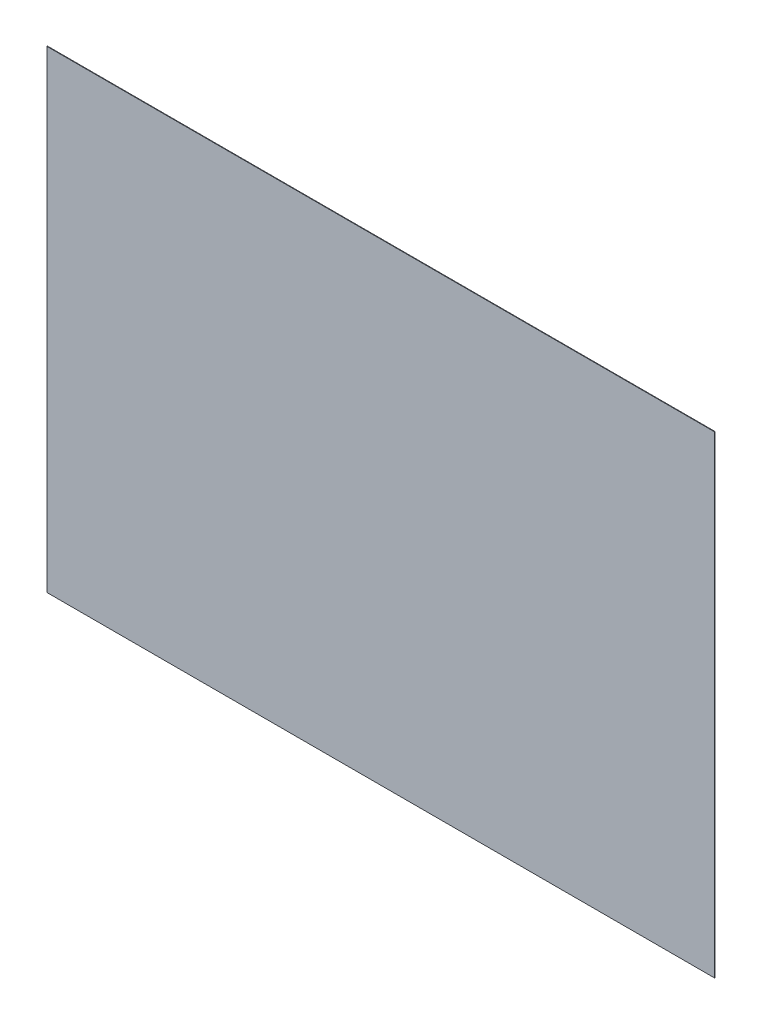
ISO-10303-21;
HEADER;
FILE_DESCRIPTION(('STEP AP214'),'2;1');
FILE_NAME('part.step','',(''),(''),'','','');
FILE_SCHEMA(('AUTOMOTIVE_DESIGN { 1 0 10303 214 1 1 1 1 }'));
ENDSEC;
DATA;
#1=APPLICATION_CONTEXT('core data for automotive mechanical design processes');
#2=APPLICATION_PROTOCOL_DEFINITION('international standard','automotive_design',2000,#1);
#3=PRODUCT_CONTEXT('',#1,'mechanical');
#4=PRODUCT('Part','Part','',(#3));
#5=PRODUCT_RELATED_PRODUCT_CATEGORY('part','',(#4));
#6=PRODUCT_DEFINITION_FORMATION('','',#4);
#7=PRODUCT_DEFINITION_CONTEXT('part definition',#1,'design');
#8=PRODUCT_DEFINITION('design','',#6,#7);
#9=PRODUCT_DEFINITION_SHAPE('','',#8);
#10=(LENGTH_UNIT() NAMED_UNIT(*) SI_UNIT(.MILLI.,.METRE.));
#11=(NAMED_UNIT(*) PLANE_ANGLE_UNIT() SI_UNIT($,.RADIAN.));
#12=(NAMED_UNIT(*) SI_UNIT($,.STERADIAN.) SOLID_ANGLE_UNIT());
#13=UNCERTAINTY_MEASURE_WITH_UNIT(LENGTH_MEASURE(1.E-05),#10,'distance_accuracy_value','');
#14=(GEOMETRIC_REPRESENTATION_CONTEXT(3) GLOBAL_UNCERTAINTY_ASSIGNED_CONTEXT((#13)) GLOBAL_UNIT_ASSIGNED_CONTEXT((#10,
#11,#12)) REPRESENTATION_CONTEXT('',''));
#15=CARTESIAN_POINT('',(0.,0.,0.));
#16=DIRECTION('',(0.,0.,1.));
#17=DIRECTION('',(1.,0.,0.));
#18=AXIS2_PLACEMENT_3D('',#15,#16,#17);
#19=CARTESIAN_POINT('',(-304.8,-215.9,0.5));
#20=DIRECTION('',(1.,0.,0.));
#21=DIRECTION('',(0.,0.,-1.));
#22=AXIS2_PLACEMENT_3D('',#19,#20,#21);
#23=PLANE('',#22);
#24=DIRECTION('',(0.,-1.,0.));
#25=VECTOR('',#24,1.);
#26=CARTESIAN_POINT('',(-304.8,-215.9,0.));
#27=LINE('',#26,#25);
#28=CARTESIAN_POINT('',(-304.8,215.9,0.));
#29=VERTEX_POINT('',#28);
#30=CARTESIAN_POINT('',(-304.8,-215.9,0.));
#31=VERTEX_POINT('',#30);
#32=EDGE_CURVE('E99',#29,#31,#27,.T.);
#33=ORIENTED_EDGE('',*,*,#32,.T.);
#34=DIRECTION('',(0.,0.,-1.));
#35=VECTOR('',#34,1.);
#36=CARTESIAN_POINT('',(-304.8,-215.9,0.5));
#37=LINE('',#36,#35);
#38=CARTESIAN_POINT('',(-304.8,-215.9,0.5));
#39=VERTEX_POINT('',#38);
#40=EDGE_CURVE('E11',#39,#31,#37,.T.);
#41=ORIENTED_EDGE('',*,*,#40,.F.);
#42=DIRECTION('',(0.,-1.,0.));
#43=VECTOR('',#42,1.);
#44=CARTESIAN_POINT('',(-304.8,-215.9,0.5));
#45=LINE('',#44,#43);
#46=CARTESIAN_POINT('',(-304.8,215.9,0.5));
#47=VERTEX_POINT('',#46);
#48=EDGE_CURVE('E87',#47,#39,#45,.T.);
#49=ORIENTED_EDGE('',*,*,#48,.F.);
#50=DIRECTION('',(0.,0.,-1.));
#51=VECTOR('',#50,1.);
#52=CARTESIAN_POINT('',(-304.8,215.9,0.5));
#53=LINE('',#52,#51);
#54=EDGE_CURVE('E95',#47,#29,#53,.T.);
#55=ORIENTED_EDGE('',*,*,#54,.T.);
#56=EDGE_LOOP('',(#33,#41,#49,#55));
#57=FACE_BOUND('',#56,.T.);
#58=ADVANCED_FACE('F36',(#57),#23,.F.);
#59=CARTESIAN_POINT('',(304.8,-215.9,0.5));
#60=DIRECTION('',(0.,1.,0.));
#61=DIRECTION('',(-1.,0.,0.));
#62=AXIS2_PLACEMENT_3D('',#59,#60,#61);
#63=PLANE('',#62);
#64=DIRECTION('',(1.,0.,0.));
#65=VECTOR('',#64,1.);
#66=CARTESIAN_POINT('',(304.8,-215.9,0.));
#67=LINE('',#66,#65);
#68=CARTESIAN_POINT('',(304.8,-215.9,0.));
#69=VERTEX_POINT('',#68);
#70=EDGE_CURVE('E91',#31,#69,#67,.T.);
#71=ORIENTED_EDGE('',*,*,#70,.T.);
#72=DIRECTION('',(0.,0.,-1.));
#73=VECTOR('',#72,1.);
#74=CARTESIAN_POINT('',(304.8,-215.9,0.5));
#75=LINE('',#74,#73);
#76=CARTESIAN_POINT('',(304.8,-215.9,0.5));
#77=VERTEX_POINT('',#76);
#78=EDGE_CURVE('E44',#77,#69,#75,.T.);
#79=ORIENTED_EDGE('',*,*,#78,.F.);
#80=DIRECTION('',(1.,0.,0.));
#81=VECTOR('',#80,1.);
#82=CARTESIAN_POINT('',(304.8,-215.9,0.5));
#83=LINE('',#82,#81);
#84=EDGE_CURVE('E82',#39,#77,#83,.T.);
#85=ORIENTED_EDGE('',*,*,#84,.F.);
#86=ORIENTED_EDGE('',*,*,#40,.T.);
#87=EDGE_LOOP('',(#71,#79,#85,#86));
#88=FACE_BOUND('',#87,.T.);
#89=ADVANCED_FACE('F90',(#88),#63,.F.);
#90=CARTESIAN_POINT('',(304.8,-215.9,0.5));
#91=DIRECTION('',(-1.,0.,0.));
#92=DIRECTION('',(0.,0.,1.));
#93=AXIS2_PLACEMENT_3D('',#90,#91,#92);
#94=PLANE('',#93);
#95=DIRECTION('',(0.,1.,0.));
#96=VECTOR('',#95,1.);
#97=CARTESIAN_POINT('',(304.8,-215.9,0.));
#98=LINE('',#97,#96);
#99=CARTESIAN_POINT('',(304.8,215.9,0.));
#100=VERTEX_POINT('',#99);
#101=EDGE_CURVE('E69',#69,#100,#98,.T.);
#102=ORIENTED_EDGE('',*,*,#101,.T.);
#103=DIRECTION('',(0.,0.,-1.));
#104=VECTOR('',#103,1.);
#105=CARTESIAN_POINT('',(304.8,215.9,0.5));
#106=LINE('',#105,#104);
#107=CARTESIAN_POINT('',(304.8,215.9,0.5));
#108=VERTEX_POINT('',#107);
#109=EDGE_CURVE('E92',#108,#100,#106,.T.);
#110=ORIENTED_EDGE('',*,*,#109,.F.);
#111=DIRECTION('',(0.,1.,0.));
#112=VECTOR('',#111,1.);
#113=CARTESIAN_POINT('',(304.8,-215.9,0.5));
#114=LINE('',#113,#112);
#115=EDGE_CURVE('E85',#77,#108,#114,.T.);
#116=ORIENTED_EDGE('',*,*,#115,.F.);
#117=ORIENTED_EDGE('',*,*,#78,.T.);
#118=EDGE_LOOP('',(#102,#110,#116,#117));
#119=FACE_BOUND('',#118,.T.);
#120=ADVANCED_FACE('F93',(#119),#94,.F.);
#121=CARTESIAN_POINT('',(304.8,215.9,0.5));
#122=DIRECTION('',(0.,-1.,0.));
#123=DIRECTION('',(1.,0.,0.));
#124=AXIS2_PLACEMENT_3D('',#121,#122,#123);
#125=PLANE('',#124);
#126=DIRECTION('',(-1.,0.,0.));
#127=VECTOR('',#126,1.);
#128=CARTESIAN_POINT('',(304.8,215.9,0.));
#129=LINE('',#128,#127);
#130=EDGE_CURVE('E75',#100,#29,#129,.T.);
#131=ORIENTED_EDGE('',*,*,#130,.T.);
#132=ORIENTED_EDGE('',*,*,#54,.F.);
#133=DIRECTION('',(-1.,0.,0.));
#134=VECTOR('',#133,1.);
#135=CARTESIAN_POINT('',(304.8,215.9,0.5));
#136=LINE('',#135,#134);
#137=EDGE_CURVE('E52',#108,#47,#136,.T.);
#138=ORIENTED_EDGE('',*,*,#137,.F.);
#139=ORIENTED_EDGE('',*,*,#109,.T.);
#140=EDGE_LOOP('',(#131,#132,#138,#139));
#141=FACE_BOUND('',#140,.T.);
#142=ADVANCED_FACE('F106',(#141),#125,.F.);
#143=CARTESIAN_POINT('',(0.,0.,0.5));
#144=DIRECTION('',(0.,0.,1.));
#145=DIRECTION('',(1.,0.,0.));
#146=AXIS2_PLACEMENT_3D('',#143,#144,#145);
#147=PLANE('',#146);
#148=ORIENTED_EDGE('',*,*,#48,.T.);
#149=ORIENTED_EDGE('',*,*,#84,.T.);
#150=ORIENTED_EDGE('',*,*,#115,.T.);
#151=ORIENTED_EDGE('',*,*,#137,.T.);
#152=EDGE_LOOP('',(#148,#149,#150,#151));
#153=FACE_BOUND('',#152,.T.);
#154=ADVANCED_FACE('F83',(#153),#147,.T.);
#155=CARTESIAN_POINT('',(0.,0.,0.));
#156=DIRECTION('',(0.,0.,1.));
#157=DIRECTION('',(1.,0.,0.));
#158=AXIS2_PLACEMENT_3D('',#155,#156,#157);
#159=PLANE('',#158);
#160=ORIENTED_EDGE('',*,*,#32,.F.);
#161=ORIENTED_EDGE('',*,*,#130,.F.);
#162=ORIENTED_EDGE('',*,*,#101,.F.);
#163=ORIENTED_EDGE('',*,*,#70,.F.);
#164=EDGE_LOOP('',(#160,#161,#162,#163));
#165=FACE_BOUND('',#164,.T.);
#166=ADVANCED_FACE('F109',(#165),#159,.F.);
#167=CLOSED_SHELL('',(#58,#89,#120,#142,#154,#166));
#168=MANIFOLD_SOLID_BREP('B2',#167);
#169=ADVANCED_BREP_SHAPE_REPRESENTATION('',(#18,#168),#14);
#170=SHAPE_DEFINITION_REPRESENTATION(#9,#169);
ENDSEC;
END-ISO-10303-21;
